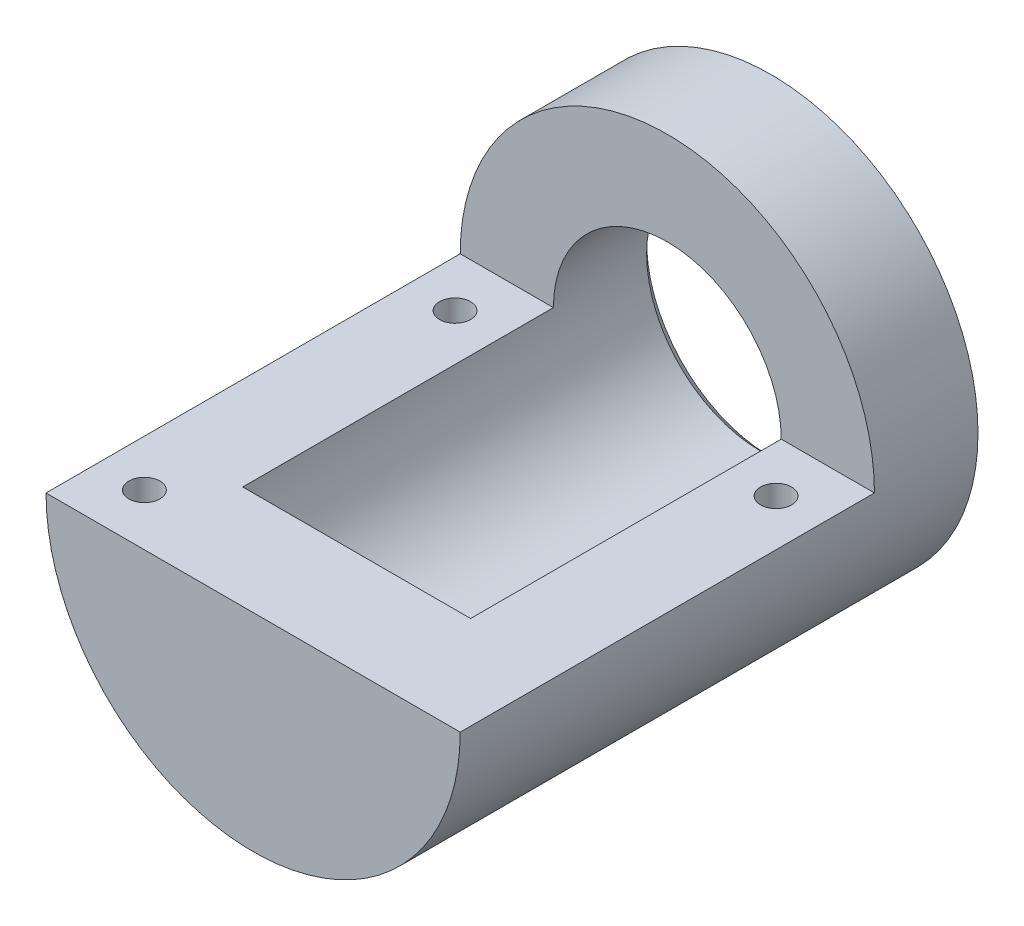
ISO-10303-21;
HEADER;
FILE_DESCRIPTION(('STEP AP214'),'2;1');
FILE_NAME('part.step','',(''),(''),'','','');
FILE_SCHEMA(('AUTOMOTIVE_DESIGN { 1 0 10303 214 1 1 1 1 }'));
ENDSEC;
DATA;
#1=APPLICATION_CONTEXT('core data for automotive mechanical design processes');
#2=APPLICATION_PROTOCOL_DEFINITION('international standard','automotive_design',2000,#1);
#3=PRODUCT_CONTEXT('',#1,'mechanical');
#4=PRODUCT('Part','Part','',(#3));
#5=PRODUCT_RELATED_PRODUCT_CATEGORY('part','',(#4));
#6=PRODUCT_DEFINITION_FORMATION('','',#4);
#7=PRODUCT_DEFINITION_CONTEXT('part definition',#1,'design');
#8=PRODUCT_DEFINITION('design','',#6,#7);
#9=PRODUCT_DEFINITION_SHAPE('','',#8);
#10=(LENGTH_UNIT() NAMED_UNIT(*) SI_UNIT(.MILLI.,.METRE.));
#11=(NAMED_UNIT(*) PLANE_ANGLE_UNIT() SI_UNIT($,.RADIAN.));
#12=(NAMED_UNIT(*) SI_UNIT($,.STERADIAN.) SOLID_ANGLE_UNIT());
#13=UNCERTAINTY_MEASURE_WITH_UNIT(LENGTH_MEASURE(1.E-05),#10,'distance_accuracy_value','');
#14=(GEOMETRIC_REPRESENTATION_CONTEXT(3) GLOBAL_UNCERTAINTY_ASSIGNED_CONTEXT((#13)) GLOBAL_UNIT_ASSIGNED_CONTEXT((#10,
#11,#12)) REPRESENTATION_CONTEXT('',''));
#15=CARTESIAN_POINT('',(0.,0.,0.));
#16=DIRECTION('',(0.,0.,1.));
#17=DIRECTION('',(1.,0.,0.));
#18=AXIS2_PLACEMENT_3D('',#15,#16,#17);
#19=CARTESIAN_POINT('',(0.,0.,0.));
#20=DIRECTION('',(0.,0.,-1.));
#21=DIRECTION('',(-1.,0.,0.));
#22=AXIS2_PLACEMENT_3D('',#19,#20,#21);
#23=CONICAL_SURFACE('',#22,12.,0.785398163397449);
#24=CARTESIAN_POINT('',(0.,0.,0.));
#25=DIRECTION('',(0.,0.,1.));
#26=DIRECTION('',(1.,0.,0.));
#27=AXIS2_PLACEMENT_3D('',#24,#25,#26);
#28=CIRCLE('',#27,12.);
#29=CARTESIAN_POINT('',(12.,0.,0.));
#30=VERTEX_POINT('',#29);
#31=EDGE_CURVE('E70',#30,#30,#28,.T.);
#32=ORIENTED_EDGE('',*,*,#31,.F.);
#33=EDGE_LOOP('',(#32));
#34=FACE_BOUND('',#33,.T.);
#35=CARTESIAN_POINT('',(0.,0.,0.999999999999999));
#36=DIRECTION('',(0.,0.,1.));
#37=DIRECTION('',(1.,0.,0.));
#38=AXIS2_PLACEMENT_3D('',#35,#36,#37);
#39=CIRCLE('',#38,11.);
#40=CARTESIAN_POINT('',(11.,0.,0.999999999999999));
#41=VERTEX_POINT('',#40);
#42=EDGE_CURVE('E13',#41,#41,#39,.F.);
#43=ORIENTED_EDGE('',*,*,#42,.F.);
#44=EDGE_LOOP('',(#43));
#45=FACE_BOUND('',#44,.T.);
#46=ADVANCED_FACE('F62',(#34,#45),#23,.F.);
#47=CARTESIAN_POINT('',(0.,0.,10.));
#48=DIRECTION('',(0.,0.,-1.));
#49=DIRECTION('',(-1.,0.,0.));
#50=AXIS2_PLACEMENT_3D('',#47,#48,#49);
#51=CYLINDRICAL_SURFACE('',#50,11.);
#52=ORIENTED_EDGE('',*,*,#42,.T.);
#53=EDGE_LOOP('',(#52));
#54=FACE_BOUND('',#53,.T.);
#55=DIRECTION('',(0.,0.,-1.));
#56=VECTOR('',#55,1.);
#57=CARTESIAN_POINT('',(-11.,0.,50.));
#58=LINE('',#57,#56);
#59=CARTESIAN_POINT('',(-11.,0.,40.));
#60=VERTEX_POINT('',#59);
#61=CARTESIAN_POINT('',(-11.,0.,10.));
#62=VERTEX_POINT('',#61);
#63=EDGE_CURVE('E77',#60,#62,#58,.T.);
#64=ORIENTED_EDGE('',*,*,#63,.F.);
#65=CARTESIAN_POINT('',(0.,0.,40.));
#66=DIRECTION('',(0.,0.,1.));
#67=DIRECTION('',(1.,0.,0.));
#68=AXIS2_PLACEMENT_3D('',#65,#66,#67);
#69=CIRCLE('',#68,11.);
#70=CARTESIAN_POINT('',(11.,0.,40.));
#71=VERTEX_POINT('',#70);
#72=EDGE_CURVE('E108',#60,#71,#69,.T.);
#73=ORIENTED_EDGE('',*,*,#72,.T.);
#74=DIRECTION('',(0.,0.,-1.));
#75=VECTOR('',#74,1.);
#76=CARTESIAN_POINT('',(11.,0.,50.));
#77=LINE('',#76,#75);
#78=CARTESIAN_POINT('',(11.,0.,10.));
#79=VERTEX_POINT('',#78);
#80=EDGE_CURVE('E115',#71,#79,#77,.T.);
#81=ORIENTED_EDGE('',*,*,#80,.T.);
#82=CARTESIAN_POINT('',(0.,0.,10.));
#83=DIRECTION('',(0.,0.,1.));
#84=DIRECTION('',(1.,0.,0.));
#85=AXIS2_PLACEMENT_3D('',#82,#83,#84);
#86=CIRCLE('',#85,11.);
#87=EDGE_CURVE('E124',#79,#62,#86,.T.);
#88=ORIENTED_EDGE('',*,*,#87,.T.);
#89=EDGE_LOOP('',(#64,#73,#81,#88));
#90=FACE_BOUND('',#89,.T.);
#91=ADVANCED_FACE('F113',(#54,#90),#51,.F.);
#92=CARTESIAN_POINT('',(0.,0.,10.));
#93=DIRECTION('',(0.,0.,1.));
#94=DIRECTION('',(1.,0.,0.));
#95=AXIS2_PLACEMENT_3D('',#92,#93,#94);
#96=PLANE('',#95);
#97=DIRECTION('',(-1.,0.,0.));
#98=VECTOR('',#97,1.);
#99=CARTESIAN_POINT('',(-20.,0.,10.));
#100=LINE('',#99,#98);
#101=CARTESIAN_POINT('',(-20.,0.,10.));
#102=VERTEX_POINT('',#101);
#103=EDGE_CURVE('E193',#62,#102,#100,.T.);
#104=ORIENTED_EDGE('',*,*,#103,.F.);
#105=ORIENTED_EDGE('',*,*,#87,.F.);
#106=DIRECTION('',(-1.,0.,0.));
#107=VECTOR('',#106,1.);
#108=CARTESIAN_POINT('',(11.,0.,10.));
#109=LINE('',#108,#107);
#110=CARTESIAN_POINT('',(20.,0.,10.));
#111=VERTEX_POINT('',#110);
#112=EDGE_CURVE('E117',#111,#79,#109,.T.);
#113=ORIENTED_EDGE('',*,*,#112,.F.);
#114=CARTESIAN_POINT('',(0.,0.,10.));
#115=DIRECTION('',(0.,0.,1.));
#116=DIRECTION('',(1.,0.,0.));
#117=AXIS2_PLACEMENT_3D('',#114,#115,#116);
#118=CIRCLE('',#117,20.);
#119=EDGE_CURVE('E131',#111,#102,#118,.T.);
#120=ORIENTED_EDGE('',*,*,#119,.T.);
#121=EDGE_LOOP('',(#104,#105,#113,#120));
#122=FACE_BOUND('',#121,.T.);
#123=ADVANCED_FACE('F145',(#122),#96,.T.);
#124=CARTESIAN_POINT('',(0.,0.,0.));
#125=DIRECTION('',(0.,0.,1.));
#126=DIRECTION('',(1.,0.,0.));
#127=AXIS2_PLACEMENT_3D('',#124,#125,#126);
#128=PLANE('',#127);
#129=ORIENTED_EDGE('',*,*,#31,.T.);
#130=EDGE_LOOP('',(#129));
#131=FACE_BOUND('',#130,.T.);
#132=CARTESIAN_POINT('',(0.,0.,0.));
#133=DIRECTION('',(0.,0.,1.));
#134=DIRECTION('',(1.,0.,0.));
#135=AXIS2_PLACEMENT_3D('',#132,#133,#134);
#136=CIRCLE('',#135,20.);
#137=CARTESIAN_POINT('',(20.,0.,0.));
#138=VERTEX_POINT('',#137);
#139=EDGE_CURVE('E130',#138,#138,#136,.T.);
#140=ORIENTED_EDGE('',*,*,#139,.F.);
#141=EDGE_LOOP('',(#140));
#142=FACE_BOUND('',#141,.T.);
#143=ADVANCED_FACE('F137',(#131,#142),#128,.F.);
#144=CARTESIAN_POINT('',(0.,0.,10.));
#145=DIRECTION('',(0.,0.,-1.));
#146=DIRECTION('',(-1.,0.,0.));
#147=AXIS2_PLACEMENT_3D('',#144,#145,#146);
#148=CYLINDRICAL_SURFACE('',#147,20.);
#149=DIRECTION('',(0.,0.,-1.));
#150=VECTOR('',#149,1.);
#151=CARTESIAN_POINT('',(-20.,0.,50.));
#152=LINE('',#151,#150);
#153=CARTESIAN_POINT('',(-20.,0.,50.));
#154=VERTEX_POINT('',#153);
#155=EDGE_CURVE('E85',#154,#102,#152,.T.);
#156=ORIENTED_EDGE('',*,*,#155,.T.);
#157=ORIENTED_EDGE('',*,*,#119,.F.);
#158=DIRECTION('',(0.,0.,-1.));
#159=VECTOR('',#158,1.);
#160=CARTESIAN_POINT('',(20.,0.,50.));
#161=LINE('',#160,#159);
#162=CARTESIAN_POINT('',(20.,0.,50.));
#163=VERTEX_POINT('',#162);
#164=EDGE_CURVE('E122',#163,#111,#161,.T.);
#165=ORIENTED_EDGE('',*,*,#164,.F.);
#166=CARTESIAN_POINT('',(0.,0.,50.));
#167=DIRECTION('',(0.,0.,1.));
#168=DIRECTION('',(1.,0.,0.));
#169=AXIS2_PLACEMENT_3D('',#166,#167,#168);
#170=CIRCLE('',#169,20.);
#171=EDGE_CURVE('E189',#154,#163,#170,.T.);
#172=ORIENTED_EDGE('',*,*,#171,.F.);
#173=EDGE_LOOP('',(#156,#157,#165,#172));
#174=FACE_BOUND('',#173,.T.);
#175=ORIENTED_EDGE('',*,*,#139,.T.);
#176=EDGE_LOOP('',(#175));
#177=FACE_BOUND('',#176,.T.);
#178=ADVANCED_FACE('F156',(#174,#177),#148,.T.);
#179=CARTESIAN_POINT('',(11.,0.,50.));
#180=DIRECTION('',(0.,-1.,0.));
#181=DIRECTION('',(0.,0.,-1.));
#182=AXIS2_PLACEMENT_3D('',#179,#180,#181);
#183=PLANE('',#182);
#184=CARTESIAN_POINT('',(-15.5,0.,45.));
#185=DIRECTION('',(0.,1.,0.));
#186=DIRECTION('',(0.,0.,1.));
#187=AXIS2_PLACEMENT_3D('',#184,#185,#186);
#188=CIRCLE('',#187,1.5000000000041);
#189=CARTESIAN_POINT('',(-15.5,0.,46.5000000000041));
#190=VERTEX_POINT('',#189);
#191=EDGE_CURVE('E173',#190,#190,#188,.T.);
#192=ORIENTED_EDGE('',*,*,#191,.F.);
#193=EDGE_LOOP('',(#192));
#194=FACE_BOUND('',#193,.T.);
#195=CARTESIAN_POINT('',(15.5,0.,15.));
#196=DIRECTION('',(0.,1.,0.));
#197=DIRECTION('',(0.,0.,1.));
#198=AXIS2_PLACEMENT_3D('',#195,#196,#197);
#199=CIRCLE('',#198,1.50000000000409);
#200=CARTESIAN_POINT('',(15.5,0.,16.5000000000041));
#201=VERTEX_POINT('',#200);
#202=EDGE_CURVE('E177',#201,#201,#199,.T.);
#203=ORIENTED_EDGE('',*,*,#202,.F.);
#204=EDGE_LOOP('',(#203));
#205=FACE_BOUND('',#204,.T.);
#206=CARTESIAN_POINT('',(-15.5,0.,15.));
#207=DIRECTION('',(0.,1.,0.));
#208=DIRECTION('',(0.,0.,1.));
#209=AXIS2_PLACEMENT_3D('',#206,#207,#208);
#210=CIRCLE('',#209,1.5000000000041);
#211=CARTESIAN_POINT('',(-15.5,0.,16.5000000000041));
#212=VERTEX_POINT('',#211);
#213=EDGE_CURVE('E180',#212,#212,#210,.T.);
#214=ORIENTED_EDGE('',*,*,#213,.F.);
#215=EDGE_LOOP('',(#214));
#216=FACE_BOUND('',#215,.T.);
#217=ORIENTED_EDGE('',*,*,#164,.T.);
#218=ORIENTED_EDGE('',*,*,#112,.T.);
#219=ORIENTED_EDGE('',*,*,#80,.F.);
#220=DIRECTION('',(-1.,0.,0.));
#221=VECTOR('',#220,1.);
#222=CARTESIAN_POINT('',(-20.,0.,40.));
#223=LINE('',#222,#221);
#224=EDGE_CURVE('E105',#71,#60,#223,.T.);
#225=ORIENTED_EDGE('',*,*,#224,.T.);
#226=ORIENTED_EDGE('',*,*,#63,.T.);
#227=ORIENTED_EDGE('',*,*,#103,.T.);
#228=ORIENTED_EDGE('',*,*,#155,.F.);
#229=DIRECTION('',(-1.,0.,0.));
#230=VECTOR('',#229,1.);
#231=CARTESIAN_POINT('',(11.,0.,50.));
#232=LINE('',#231,#230);
#233=EDGE_CURVE('E192',#163,#154,#232,.T.);
#234=ORIENTED_EDGE('',*,*,#233,.F.);
#235=EDGE_LOOP('',(#217,#218,#219,#225,#226,#227,#228,#234));
#236=FACE_BOUND('',#235,.T.);
#237=ADVANCED_FACE('F120',(#194,#205,#216,#236),#183,.F.);
#238=CARTESIAN_POINT('',(0.,0.,50.));
#239=DIRECTION('',(0.,0.,1.));
#240=DIRECTION('',(1.,0.,0.));
#241=AXIS2_PLACEMENT_3D('',#238,#239,#240);
#242=PLANE('',#241);
#243=ORIENTED_EDGE('',*,*,#171,.T.);
#244=ORIENTED_EDGE('',*,*,#233,.T.);
#245=EDGE_LOOP('',(#243,#244));
#246=FACE_BOUND('',#245,.T.);
#247=ADVANCED_FACE('F162',(#246),#242,.T.);
#248=CARTESIAN_POINT('',(0.,0.,40.));
#249=DIRECTION('',(0.,0.,1.));
#250=DIRECTION('',(1.,0.,0.));
#251=AXIS2_PLACEMENT_3D('',#248,#249,#250);
#252=PLANE('',#251);
#253=ORIENTED_EDGE('',*,*,#72,.F.);
#254=ORIENTED_EDGE('',*,*,#224,.F.);
#255=EDGE_LOOP('',(#253,#254));
#256=FACE_BOUND('',#255,.T.);
#257=ADVANCED_FACE('F107',(#256),#252,.F.);
#258=CARTESIAN_POINT('',(-15.5,-8.,15.));
#259=DIRECTION('',(0.,1.,0.));
#260=DIRECTION('',(0.,0.,1.));
#261=AXIS2_PLACEMENT_3D('',#258,#259,#260);
#262=CYLINDRICAL_SURFACE('',#261,1.5000000000041);
#263=CARTESIAN_POINT('',(-15.5,-8.,15.));
#264=DIRECTION('',(0.,1.,0.));
#265=DIRECTION('',(0.,0.,1.));
#266=AXIS2_PLACEMENT_3D('',#263,#264,#265);
#267=CIRCLE('',#266,1.5000000000041);
#268=CARTESIAN_POINT('',(-15.5,-8.,16.5000000000041));
#269=VERTEX_POINT('',#268);
#270=EDGE_CURVE('E110',#269,#269,#267,.T.);
#271=ORIENTED_EDGE('',*,*,#270,.F.);
#272=EDGE_LOOP('',(#271));
#273=FACE_BOUND('',#272,.T.);
#274=ORIENTED_EDGE('',*,*,#213,.T.);
#275=EDGE_LOOP('',(#274));
#276=FACE_BOUND('',#275,.T.);
#277=ADVANCED_FACE('F217',(#273,#276),#262,.F.);
#278=CARTESIAN_POINT('',(-15.5,-8.,15.));
#279=DIRECTION('',(0.,1.,0.));
#280=DIRECTION('',(0.,0.,1.));
#281=AXIS2_PLACEMENT_3D('',#278,#279,#280);
#282=PLANE('',#281);
#283=ORIENTED_EDGE('',*,*,#270,.T.);
#284=EDGE_LOOP('',(#283));
#285=FACE_BOUND('',#284,.T.);
#286=ADVANCED_FACE('F209',(#285),#282,.T.);
#287=CARTESIAN_POINT('',(15.5,-8.,15.));
#288=DIRECTION('',(0.,1.,0.));
#289=DIRECTION('',(0.,0.,1.));
#290=AXIS2_PLACEMENT_3D('',#287,#288,#289);
#291=CYLINDRICAL_SURFACE('',#290,1.50000000000409);
#292=CARTESIAN_POINT('',(15.5,-8.,15.));
#293=DIRECTION('',(0.,1.,0.));
#294=DIRECTION('',(0.,0.,1.));
#295=AXIS2_PLACEMENT_3D('',#292,#293,#294);
#296=CIRCLE('',#295,1.50000000000409);
#297=CARTESIAN_POINT('',(15.5,-8.,16.5000000000041));
#298=VERTEX_POINT('',#297);
#299=EDGE_CURVE('E185',#298,#298,#296,.T.);
#300=ORIENTED_EDGE('',*,*,#299,.F.);
#301=EDGE_LOOP('',(#300));
#302=FACE_BOUND('',#301,.T.);
#303=ORIENTED_EDGE('',*,*,#202,.T.);
#304=EDGE_LOOP('',(#303));
#305=FACE_BOUND('',#304,.T.);
#306=ADVANCED_FACE('F206',(#302,#305),#291,.F.);
#307=CARTESIAN_POINT('',(15.5,-8.,15.));
#308=DIRECTION('',(0.,1.,0.));
#309=DIRECTION('',(0.,0.,1.));
#310=AXIS2_PLACEMENT_3D('',#307,#308,#309);
#311=PLANE('',#310);
#312=ORIENTED_EDGE('',*,*,#299,.T.);
#313=EDGE_LOOP('',(#312));
#314=FACE_BOUND('',#313,.T.);
#315=ADVANCED_FACE('F204',(#314),#311,.T.);
#316=CARTESIAN_POINT('',(-15.5,-8.,45.));
#317=DIRECTION('',(0.,1.,0.));
#318=DIRECTION('',(0.,0.,1.));
#319=AXIS2_PLACEMENT_3D('',#316,#317,#318);
#320=CYLINDRICAL_SURFACE('',#319,1.5000000000041);
#321=CARTESIAN_POINT('',(-15.5,-8.,45.));
#322=DIRECTION('',(0.,1.,0.));
#323=DIRECTION('',(0.,0.,1.));
#324=AXIS2_PLACEMENT_3D('',#321,#322,#323);
#325=CIRCLE('',#324,1.5000000000041);
#326=CARTESIAN_POINT('',(-15.5,-8.,46.5000000000041));
#327=VERTEX_POINT('',#326);
#328=EDGE_CURVE('E197',#327,#327,#325,.T.);
#329=ORIENTED_EDGE('',*,*,#328,.F.);
#330=EDGE_LOOP('',(#329));
#331=FACE_BOUND('',#330,.T.);
#332=ORIENTED_EDGE('',*,*,#191,.T.);
#333=EDGE_LOOP('',(#332));
#334=FACE_BOUND('',#333,.T.);
#335=ADVANCED_FACE('F215',(#331,#334),#320,.F.);
#336=CARTESIAN_POINT('',(-15.5,-8.,45.));
#337=DIRECTION('',(0.,1.,0.));
#338=DIRECTION('',(0.,0.,1.));
#339=AXIS2_PLACEMENT_3D('',#336,#337,#338);
#340=PLANE('',#339);
#341=ORIENTED_EDGE('',*,*,#328,.T.);
#342=EDGE_LOOP('',(#341));
#343=FACE_BOUND('',#342,.T.);
#344=ADVANCED_FACE('F223',(#343),#340,.T.);
#345=CLOSED_SHELL('',(#46,#91,#123,#143,#178,#237,#247,#257,#277,#286,#306,#315,#335,#344));
#346=MANIFOLD_SOLID_BREP('B2',#345);
#347=ADVANCED_BREP_SHAPE_REPRESENTATION('',(#18,#346),#14);
#348=SHAPE_DEFINITION_REPRESENTATION(#9,#347);
ENDSEC;
END-ISO-10303-21;
